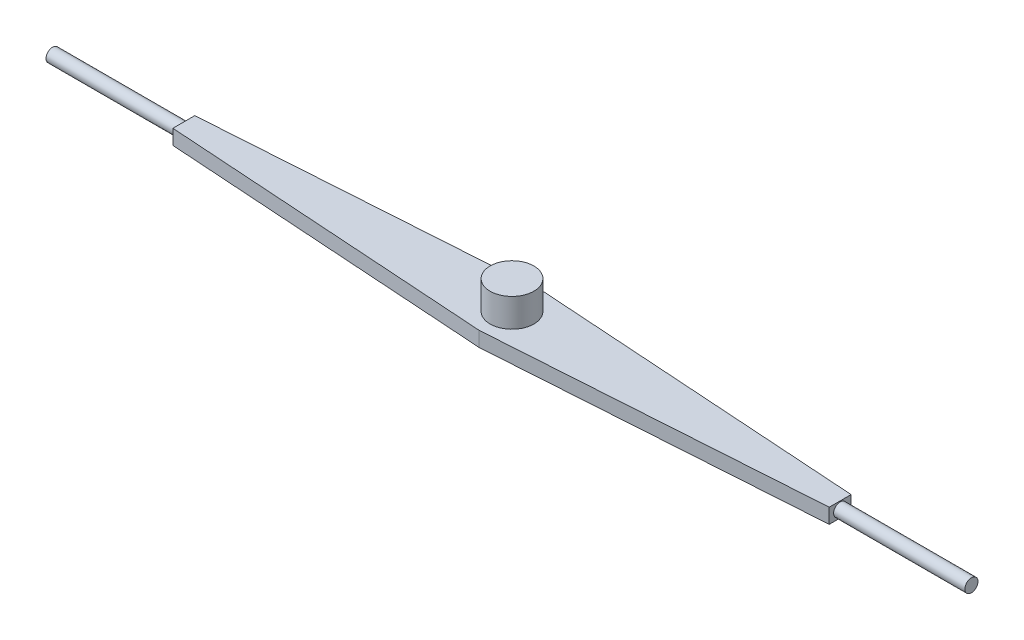
ISO-10303-21;
HEADER;
FILE_DESCRIPTION(('STEP AP214'),'2;1');
FILE_NAME('part.step','',(''),(''),'','','');
FILE_SCHEMA(('AUTOMOTIVE_DESIGN { 1 0 10303 214 1 1 1 1 }'));
ENDSEC;
DATA;
#1=APPLICATION_CONTEXT('core data for automotive mechanical design processes');
#2=APPLICATION_PROTOCOL_DEFINITION('international standard','automotive_design',2000,#1);
#3=PRODUCT_CONTEXT('',#1,'mechanical');
#4=PRODUCT('Part','Part','',(#3));
#5=PRODUCT_RELATED_PRODUCT_CATEGORY('part','',(#4));
#6=PRODUCT_DEFINITION_FORMATION('','',#4);
#7=PRODUCT_DEFINITION_CONTEXT('part definition',#1,'design');
#8=PRODUCT_DEFINITION('design','',#6,#7);
#9=PRODUCT_DEFINITION_SHAPE('','',#8);
#10=(LENGTH_UNIT() NAMED_UNIT(*) SI_UNIT(.MILLI.,.METRE.));
#11=(NAMED_UNIT(*) PLANE_ANGLE_UNIT() SI_UNIT($,.RADIAN.));
#12=(NAMED_UNIT(*) SI_UNIT($,.STERADIAN.) SOLID_ANGLE_UNIT());
#13=UNCERTAINTY_MEASURE_WITH_UNIT(LENGTH_MEASURE(1.E-05),#10,'distance_accuracy_value','');
#14=(GEOMETRIC_REPRESENTATION_CONTEXT(3) GLOBAL_UNCERTAINTY_ASSIGNED_CONTEXT((#13)) GLOBAL_UNIT_ASSIGNED_CONTEXT((#10,
#11,#12)) REPRESENTATION_CONTEXT('',''));
#15=CARTESIAN_POINT('',(0.,0.,0.));
#16=DIRECTION('',(0.,0.,1.));
#17=DIRECTION('',(1.,0.,0.));
#18=AXIS2_PLACEMENT_3D('',#15,#16,#17);
#19=CARTESIAN_POINT('',(360.,-3.4,-5.));
#20=DIRECTION('',(-1.,0.,0.));
#21=DIRECTION('',(0.,0.,1.));
#22=AXIS2_PLACEMENT_3D('',#19,#20,#21);
#23=CYLINDRICAL_SURFACE('',#22,3.);
#24=CARTESIAN_POINT('',(360.,-3.4,-5.));
#25=DIRECTION('',(1.,0.,0.));
#26=DIRECTION('',(0.,0.,-1.));
#27=AXIS2_PLACEMENT_3D('',#24,#25,#26);
#28=CIRCLE('',#27,3.);
#29=CARTESIAN_POINT('',(360.,-3.4,-8.));
#30=VERTEX_POINT('',#29);
#31=EDGE_CURVE('E11',#30,#30,#28,.T.);
#32=ORIENTED_EDGE('',*,*,#31,.F.);
#33=EDGE_LOOP('',(#32));
#34=FACE_BOUND('',#33,.T.);
#35=CARTESIAN_POINT('',(300.,-3.4,-5.));
#36=DIRECTION('',(1.,0.,0.));
#37=DIRECTION('',(0.,0.,-1.));
#38=AXIS2_PLACEMENT_3D('',#35,#36,#37);
#39=CIRCLE('',#38,3.);
#40=CARTESIAN_POINT('',(300.,-3.4,-8.));
#41=VERTEX_POINT('',#40);
#42=EDGE_CURVE('E49',#41,#41,#39,.T.);
#43=ORIENTED_EDGE('',*,*,#42,.T.);
#44=EDGE_LOOP('',(#43));
#45=FACE_BOUND('',#44,.T.);
#46=ADVANCED_FACE('F46',(#34,#45),#23,.T.);
#47=CARTESIAN_POINT('',(360.,-3.4,-5.));
#48=DIRECTION('',(1.,0.,0.));
#49=DIRECTION('',(0.,0.,-1.));
#50=AXIS2_PLACEMENT_3D('',#47,#48,#49);
#51=PLANE('',#50);
#52=ORIENTED_EDGE('',*,*,#31,.T.);
#53=EDGE_LOOP('',(#52));
#54=FACE_BOUND('',#53,.T.);
#55=ADVANCED_FACE('F61',(#54),#51,.T.);
#56=CARTESIAN_POINT('',(300.,-3.4,-5.));
#57=DIRECTION('',(1.,0.,0.));
#58=DIRECTION('',(0.,0.,-1.));
#59=AXIS2_PLACEMENT_3D('',#56,#57,#58);
#60=PLANE('',#59);
#61=ORIENTED_EDGE('',*,*,#42,.F.);
#62=EDGE_LOOP('',(#61));
#63=FACE_BOUND('',#62,.T.);
#64=ADVANCED_FACE('F59',(#63),#60,.F.);
#65=CLOSED_SHELL('',(#46,#55,#64));
#66=MANIFOLD_SOLID_BREP('B2',#65);
#67=CARTESIAN_POINT('',(-60.,-3.4,-5.));
#68=DIRECTION('',(1.,0.,0.));
#69=DIRECTION('',(0.,0.,-1.));
#70=AXIS2_PLACEMENT_3D('',#67,#68,#69);
#71=CYLINDRICAL_SURFACE('',#70,3.);
#72=CARTESIAN_POINT('',(-60.,-3.4,-5.));
#73=DIRECTION('',(-1.,0.,0.));
#74=DIRECTION('',(0.,0.,1.));
#75=AXIS2_PLACEMENT_3D('',#72,#73,#74);
#76=CIRCLE('',#75,3.);
#77=CARTESIAN_POINT('',(-60.,-3.4,-2.));
#78=VERTEX_POINT('',#77);
#79=EDGE_CURVE('E45',#78,#78,#76,.T.);
#80=ORIENTED_EDGE('',*,*,#79,.F.);
#81=EDGE_LOOP('',(#80));
#82=FACE_BOUND('',#81,.T.);
#83=CARTESIAN_POINT('',(0.,-3.4,-5.));
#84=DIRECTION('',(-1.,0.,0.));
#85=DIRECTION('',(0.,0.,1.));
#86=AXIS2_PLACEMENT_3D('',#83,#84,#85);
#87=CIRCLE('',#86,3.);
#88=CARTESIAN_POINT('',(0.,-3.4,-2.));
#89=VERTEX_POINT('',#88);
#90=EDGE_CURVE('E99',#89,#89,#87,.T.);
#91=ORIENTED_EDGE('',*,*,#90,.T.);
#92=EDGE_LOOP('',(#91));
#93=FACE_BOUND('',#92,.T.);
#94=ADVANCED_FACE('F96',(#82,#93),#71,.T.);
#95=CARTESIAN_POINT('',(-60.,-3.4,-5.));
#96=DIRECTION('',(-1.,0.,0.));
#97=DIRECTION('',(0.,0.,1.));
#98=AXIS2_PLACEMENT_3D('',#95,#96,#97);
#99=PLANE('',#98);
#100=ORIENTED_EDGE('',*,*,#79,.T.);
#101=EDGE_LOOP('',(#100));
#102=FACE_BOUND('',#101,.T.);
#103=ADVANCED_FACE('F111',(#102),#99,.T.);
#104=CARTESIAN_POINT('',(0.,-3.4,-5.));
#105=DIRECTION('',(-1.,0.,0.));
#106=DIRECTION('',(0.,0.,1.));
#107=AXIS2_PLACEMENT_3D('',#104,#105,#106);
#108=PLANE('',#107);
#109=ORIENTED_EDGE('',*,*,#90,.F.);
#110=EDGE_LOOP('',(#109));
#111=FACE_BOUND('',#110,.T.);
#112=ADVANCED_FACE('F109',(#111),#108,.F.);
#113=CLOSED_SHELL('',(#94,#103,#112));
#114=MANIFOLD_SOLID_BREP('B6',#113);
#115=CARTESIAN_POINT('',(0.,-6.8,0.));
#116=DIRECTION('',(-0.0665190105237739,0.,0.997785157856609));
#117=DIRECTION('',(0.997785157856609,0.,0.0665190105237739));
#118=AXIS2_PLACEMENT_3D('',#115,#116,#117);
#119=PLANE('',#118);
#120=DIRECTION('',(0.997785157856609,0.,0.0665190105237739));
#121=VECTOR('',#120,1.);
#122=CARTESIAN_POINT('',(0.,0.,0.));
#123=LINE('',#122,#121);
#124=CARTESIAN_POINT('',(0.,0.,0.));
#125=VERTEX_POINT('',#124);
#126=CARTESIAN_POINT('',(150.,0.,10.));
#127=VERTEX_POINT('',#126);
#128=EDGE_CURVE('E222',#125,#127,#123,.T.);
#129=ORIENTED_EDGE('',*,*,#128,.F.);
#130=DIRECTION('',(0.,1.,0.));
#131=VECTOR('',#130,1.);
#132=CARTESIAN_POINT('',(0.,-6.8,0.));
#133=LINE('',#132,#131);
#134=CARTESIAN_POINT('',(0.,-6.8,0.));
#135=VERTEX_POINT('',#134);
#136=EDGE_CURVE('E94',#135,#125,#133,.T.);
#137=ORIENTED_EDGE('',*,*,#136,.F.);
#138=DIRECTION('',(0.997785157856609,0.,0.0665190105237739));
#139=VECTOR('',#138,1.);
#140=CARTESIAN_POINT('',(0.,-6.8,0.));
#141=LINE('',#140,#139);
#142=CARTESIAN_POINT('',(150.,-6.8,10.));
#143=VERTEX_POINT('',#142);
#144=EDGE_CURVE('E237',#135,#143,#141,.T.);
#145=ORIENTED_EDGE('',*,*,#144,.T.);
#146=DIRECTION('',(0.,1.,0.));
#147=VECTOR('',#146,1.);
#148=CARTESIAN_POINT('',(150.,-6.8,10.));
#149=LINE('',#148,#147);
#150=EDGE_CURVE('E140',#143,#127,#149,.T.);
#151=ORIENTED_EDGE('',*,*,#150,.T.);
#152=EDGE_LOOP('',(#129,#137,#145,#151));
#153=FACE_BOUND('',#152,.T.);
#154=ADVANCED_FACE('F137',(#153),#119,.T.);
#155=CARTESIAN_POINT('',(0.,-6.8,0.));
#156=DIRECTION('',(-1.,0.,0.));
#157=DIRECTION('',(0.,0.,1.));
#158=AXIS2_PLACEMENT_3D('',#155,#156,#157);
#159=PLANE('',#158);
#160=DIRECTION('',(0.,0.,1.));
#161=VECTOR('',#160,1.);
#162=CARTESIAN_POINT('',(0.,0.,0.));
#163=LINE('',#162,#161);
#164=CARTESIAN_POINT('',(0.,0.,-10.));
#165=VERTEX_POINT('',#164);
#166=EDGE_CURVE('E235',#165,#125,#163,.T.);
#167=ORIENTED_EDGE('',*,*,#166,.F.);
#168=DIRECTION('',(0.,1.,0.));
#169=VECTOR('',#168,1.);
#170=CARTESIAN_POINT('',(0.,-6.8,-10.));
#171=LINE('',#170,#169);
#172=CARTESIAN_POINT('',(0.,-6.8,-10.));
#173=VERTEX_POINT('',#172);
#174=EDGE_CURVE('E146',#173,#165,#171,.T.);
#175=ORIENTED_EDGE('',*,*,#174,.F.);
#176=DIRECTION('',(0.,0.,1.));
#177=VECTOR('',#176,1.);
#178=CARTESIAN_POINT('',(0.,-6.8,0.));
#179=LINE('',#178,#177);
#180=EDGE_CURVE('E212',#173,#135,#179,.T.);
#181=ORIENTED_EDGE('',*,*,#180,.T.);
#182=ORIENTED_EDGE('',*,*,#136,.T.);
#183=EDGE_LOOP('',(#167,#175,#181,#182));
#184=FACE_BOUND('',#183,.T.);
#185=ADVANCED_FACE('F245',(#184),#159,.T.);
#186=CARTESIAN_POINT('',(0.,-6.8,-10.));
#187=DIRECTION('',(-0.0665190105237739,0.,-0.997785157856609));
#188=DIRECTION('',(-0.997785157856609,0.,0.0665190105237739));
#189=AXIS2_PLACEMENT_3D('',#186,#187,#188);
#190=PLANE('',#189);
#191=DIRECTION('',(-0.997785157856609,0.,0.0665190105237739));
#192=VECTOR('',#191,1.);
#193=CARTESIAN_POINT('',(0.,0.,-10.));
#194=LINE('',#193,#192);
#195=CARTESIAN_POINT('',(150.,0.,-20.));
#196=VERTEX_POINT('',#195);
#197=EDGE_CURVE('E199',#196,#165,#194,.T.);
#198=ORIENTED_EDGE('',*,*,#197,.F.);
#199=DIRECTION('',(0.,1.,0.));
#200=VECTOR('',#199,1.);
#201=CARTESIAN_POINT('',(150.,-6.8,-20.));
#202=LINE('',#201,#200);
#203=CARTESIAN_POINT('',(150.,-6.8,-20.));
#204=VERTEX_POINT('',#203);
#205=EDGE_CURVE('E194',#204,#196,#202,.T.);
#206=ORIENTED_EDGE('',*,*,#205,.F.);
#207=DIRECTION('',(-0.997785157856609,0.,0.0665190105237739));
#208=VECTOR('',#207,1.);
#209=CARTESIAN_POINT('',(0.,-6.8,-10.));
#210=LINE('',#209,#208);
#211=EDGE_CURVE('E197',#204,#173,#210,.T.);
#212=ORIENTED_EDGE('',*,*,#211,.T.);
#213=ORIENTED_EDGE('',*,*,#174,.T.);
#214=EDGE_LOOP('',(#198,#206,#212,#213));
#215=FACE_BOUND('',#214,.T.);
#216=ADVANCED_FACE('F196',(#215),#190,.T.);
#217=CARTESIAN_POINT('',(300.,-6.8,-10.));
#218=DIRECTION('',(0.0665190105237739,0.,-0.997785157856609));
#219=DIRECTION('',(-0.997785157856609,0.,-0.0665190105237739));
#220=AXIS2_PLACEMENT_3D('',#217,#218,#219);
#221=PLANE('',#220);
#222=DIRECTION('',(-0.997785157856609,0.,-0.0665190105237739));
#223=VECTOR('',#222,1.);
#224=CARTESIAN_POINT('',(300.,0.,-10.));
#225=LINE('',#224,#223);
#226=CARTESIAN_POINT('',(300.,0.,-10.));
#227=VERTEX_POINT('',#226);
#228=EDGE_CURVE('E232',#227,#196,#225,.T.);
#229=ORIENTED_EDGE('',*,*,#228,.F.);
#230=DIRECTION('',(0.,1.,0.));
#231=VECTOR('',#230,1.);
#232=CARTESIAN_POINT('',(300.,-6.8,-10.));
#233=LINE('',#232,#231);
#234=CARTESIAN_POINT('',(300.,-6.8,-10.));
#235=VERTEX_POINT('',#234);
#236=EDGE_CURVE('E204',#235,#227,#233,.T.);
#237=ORIENTED_EDGE('',*,*,#236,.F.);
#238=DIRECTION('',(-0.997785157856609,0.,-0.0665190105237739));
#239=VECTOR('',#238,1.);
#240=CARTESIAN_POINT('',(300.,-6.8,-10.));
#241=LINE('',#240,#239);
#242=EDGE_CURVE('E210',#235,#204,#241,.T.);
#243=ORIENTED_EDGE('',*,*,#242,.T.);
#244=ORIENTED_EDGE('',*,*,#205,.T.);
#245=EDGE_LOOP('',(#229,#237,#243,#244));
#246=FACE_BOUND('',#245,.T.);
#247=ADVANCED_FACE('F214',(#246),#221,.T.);
#248=CARTESIAN_POINT('',(300.,-6.8,0.));
#249=DIRECTION('',(1.,0.,0.));
#250=DIRECTION('',(0.,0.,-1.));
#251=AXIS2_PLACEMENT_3D('',#248,#249,#250);
#252=PLANE('',#251);
#253=DIRECTION('',(0.,0.,-1.));
#254=VECTOR('',#253,1.);
#255=CARTESIAN_POINT('',(300.,0.,0.));
#256=LINE('',#255,#254);
#257=CARTESIAN_POINT('',(300.,0.,0.));
#258=VERTEX_POINT('',#257);
#259=EDGE_CURVE('E229',#258,#227,#256,.T.);
#260=ORIENTED_EDGE('',*,*,#259,.F.);
#261=DIRECTION('',(0.,1.,0.));
#262=VECTOR('',#261,1.);
#263=CARTESIAN_POINT('',(300.,-6.8,0.));
#264=LINE('',#263,#262);
#265=CARTESIAN_POINT('',(300.,-6.8,0.));
#266=VERTEX_POINT('',#265);
#267=EDGE_CURVE('E240',#266,#258,#264,.T.);
#268=ORIENTED_EDGE('',*,*,#267,.F.);
#269=DIRECTION('',(0.,0.,-1.));
#270=VECTOR('',#269,1.);
#271=CARTESIAN_POINT('',(300.,-6.8,0.));
#272=LINE('',#271,#270);
#273=EDGE_CURVE('E215',#266,#235,#272,.T.);
#274=ORIENTED_EDGE('',*,*,#273,.T.);
#275=ORIENTED_EDGE('',*,*,#236,.T.);
#276=EDGE_LOOP('',(#260,#268,#274,#275));
#277=FACE_BOUND('',#276,.T.);
#278=ADVANCED_FACE('F258',(#277),#252,.T.);
#279=CARTESIAN_POINT('',(300.,-6.8,0.));
#280=DIRECTION('',(0.0665190105237739,0.,0.997785157856609));
#281=DIRECTION('',(0.997785157856609,0.,-0.0665190105237739));
#282=AXIS2_PLACEMENT_3D('',#279,#280,#281);
#283=PLANE('',#282);
#284=DIRECTION('',(0.997785157856609,0.,-0.0665190105237739));
#285=VECTOR('',#284,1.);
#286=CARTESIAN_POINT('',(300.,0.,0.));
#287=LINE('',#286,#285);
#288=EDGE_CURVE('E225',#127,#258,#287,.T.);
#289=ORIENTED_EDGE('',*,*,#288,.F.);
#290=ORIENTED_EDGE('',*,*,#150,.F.);
#291=DIRECTION('',(0.997785157856609,0.,-0.0665190105237739));
#292=VECTOR('',#291,1.);
#293=CARTESIAN_POINT('',(300.,-6.8,0.));
#294=LINE('',#293,#292);
#295=EDGE_CURVE('E217',#143,#266,#294,.T.);
#296=ORIENTED_EDGE('',*,*,#295,.T.);
#297=ORIENTED_EDGE('',*,*,#267,.T.);
#298=EDGE_LOOP('',(#289,#290,#296,#297));
#299=FACE_BOUND('',#298,.T.);
#300=ADVANCED_FACE('F242',(#299),#283,.T.);
#301=CARTESIAN_POINT('',(0.,-6.8,0.));
#302=DIRECTION('',(0.,1.,0.));
#303=DIRECTION('',(0.,0.,1.));
#304=AXIS2_PLACEMENT_3D('',#301,#302,#303);
#305=PLANE('',#304);
#306=CARTESIAN_POINT('',(150.,-6.8,-5.));
#307=DIRECTION('',(0.,1.,0.));
#308=DIRECTION('',(0.,0.,1.));
#309=AXIS2_PLACEMENT_3D('',#306,#307,#308);
#310=CIRCLE('',#309,10.);
#311=CARTESIAN_POINT('',(150.,-6.8,5.00000000000001));
#312=VERTEX_POINT('',#311);
#313=EDGE_CURVE('E293',#312,#312,#310,.T.);
#314=ORIENTED_EDGE('',*,*,#313,.T.);
#315=EDGE_LOOP('',(#314));
#316=FACE_BOUND('',#315,.T.);
#317=ORIENTED_EDGE('',*,*,#144,.F.);
#318=ORIENTED_EDGE('',*,*,#180,.F.);
#319=ORIENTED_EDGE('',*,*,#211,.F.);
#320=ORIENTED_EDGE('',*,*,#242,.F.);
#321=ORIENTED_EDGE('',*,*,#273,.F.);
#322=ORIENTED_EDGE('',*,*,#295,.F.);
#323=EDGE_LOOP('',(#317,#318,#319,#320,#321,#322));
#324=FACE_BOUND('',#323,.T.);
#325=ADVANCED_FACE('F208',(#316,#324),#305,.F.);
#326=CARTESIAN_POINT('',(0.,0.,0.));
#327=DIRECTION('',(0.,1.,0.));
#328=DIRECTION('',(0.,0.,1.));
#329=AXIS2_PLACEMENT_3D('',#326,#327,#328);
#330=PLANE('',#329);
#331=CARTESIAN_POINT('',(150.,0.,-5.));
#332=DIRECTION('',(0.,1.,0.));
#333=DIRECTION('',(0.,0.,1.));
#334=AXIS2_PLACEMENT_3D('',#331,#332,#333);
#335=CIRCLE('',#334,10.);
#336=CARTESIAN_POINT('',(150.,0.,5.00000000000001));
#337=VERTEX_POINT('',#336);
#338=EDGE_CURVE('E226',#337,#337,#335,.T.);
#339=ORIENTED_EDGE('',*,*,#338,.F.);
#340=EDGE_LOOP('',(#339));
#341=FACE_BOUND('',#340,.T.);
#342=ORIENTED_EDGE('',*,*,#128,.T.);
#343=ORIENTED_EDGE('',*,*,#288,.T.);
#344=ORIENTED_EDGE('',*,*,#259,.T.);
#345=ORIENTED_EDGE('',*,*,#228,.T.);
#346=ORIENTED_EDGE('',*,*,#197,.T.);
#347=ORIENTED_EDGE('',*,*,#166,.T.);
#348=EDGE_LOOP('',(#342,#343,#344,#345,#346,#347));
#349=FACE_BOUND('',#348,.T.);
#350=ADVANCED_FACE('F244',(#341,#349),#330,.T.);
#351=CARTESIAN_POINT('',(0.,13.,0.));
#352=DIRECTION('',(0.,1.,0.));
#353=DIRECTION('',(0.,0.,1.));
#354=AXIS2_PLACEMENT_3D('',#351,#352,#353);
#355=PLANE('',#354);
#356=CARTESIAN_POINT('',(150.,13.,-5.));
#357=DIRECTION('',(0.,1.,0.));
#358=DIRECTION('',(0.,0.,1.));
#359=AXIS2_PLACEMENT_3D('',#356,#357,#358);
#360=CIRCLE('',#359,10.);
#361=CARTESIAN_POINT('',(150.,13.,5.00000000000001));
#362=VERTEX_POINT('',#361);
#363=EDGE_CURVE('E288',#362,#362,#360,.T.);
#364=ORIENTED_EDGE('',*,*,#363,.T.);
#365=EDGE_LOOP('',(#364));
#366=FACE_BOUND('',#365,.T.);
#367=ADVANCED_FACE('F269',(#366),#355,.T.);
#368=CARTESIAN_POINT('',(150.,-9.8,-5.));
#369=DIRECTION('',(0.,1.,0.));
#370=DIRECTION('',(0.,0.,1.));
#371=AXIS2_PLACEMENT_3D('',#368,#369,#370);
#372=CYLINDRICAL_SURFACE('',#371,10.);
#373=ORIENTED_EDGE('',*,*,#338,.T.);
#374=EDGE_LOOP('',(#373));
#375=FACE_BOUND('',#374,.T.);
#376=ORIENTED_EDGE('',*,*,#363,.F.);
#377=EDGE_LOOP('',(#376));
#378=FACE_BOUND('',#377,.T.);
#379=ADVANCED_FACE('F273',(#375,#378),#372,.T.);
#380=CARTESIAN_POINT('',(150.,-9.8,-5.));
#381=DIRECTION('',(0.,1.,0.));
#382=DIRECTION('',(0.,0.,1.));
#383=AXIS2_PLACEMENT_3D('',#380,#381,#382);
#384=CIRCLE('',#383,10.);
#385=CARTESIAN_POINT('',(150.,-9.8,5.00000000000001));
#386=VERTEX_POINT('',#385);
#387=EDGE_CURVE('E290',#386,#386,#384,.T.);
#388=ORIENTED_EDGE('',*,*,#387,.T.);
#389=EDGE_LOOP('',(#388));
#390=FACE_BOUND('',#389,.T.);
#391=ORIENTED_EDGE('',*,*,#313,.F.);
#392=EDGE_LOOP('',(#391));
#393=FACE_BOUND('',#392,.T.);
#394=ADVANCED_FACE('F276',(#390,#393),#372,.T.);
#395=CARTESIAN_POINT('',(0.,-9.8,0.));
#396=DIRECTION('',(0.,1.,0.));
#397=DIRECTION('',(0.,0.,1.));
#398=AXIS2_PLACEMENT_3D('',#395,#396,#397);
#399=PLANE('',#398);
#400=ORIENTED_EDGE('',*,*,#387,.F.);
#401=EDGE_LOOP('',(#400));
#402=FACE_BOUND('',#401,.T.);
#403=ADVANCED_FACE('F278',(#402),#399,.F.);
#404=CLOSED_SHELL('',(#154,#185,#216,#247,#278,#300,#325,#350,#367,#379,#394,#403));
#405=MANIFOLD_SOLID_BREP('B40',#404);
#406=ADVANCED_BREP_SHAPE_REPRESENTATION('',(#18,#66,#114,#405),#14);
#407=SHAPE_DEFINITION_REPRESENTATION(#9,#406);
ENDSEC;
END-ISO-10303-21;
